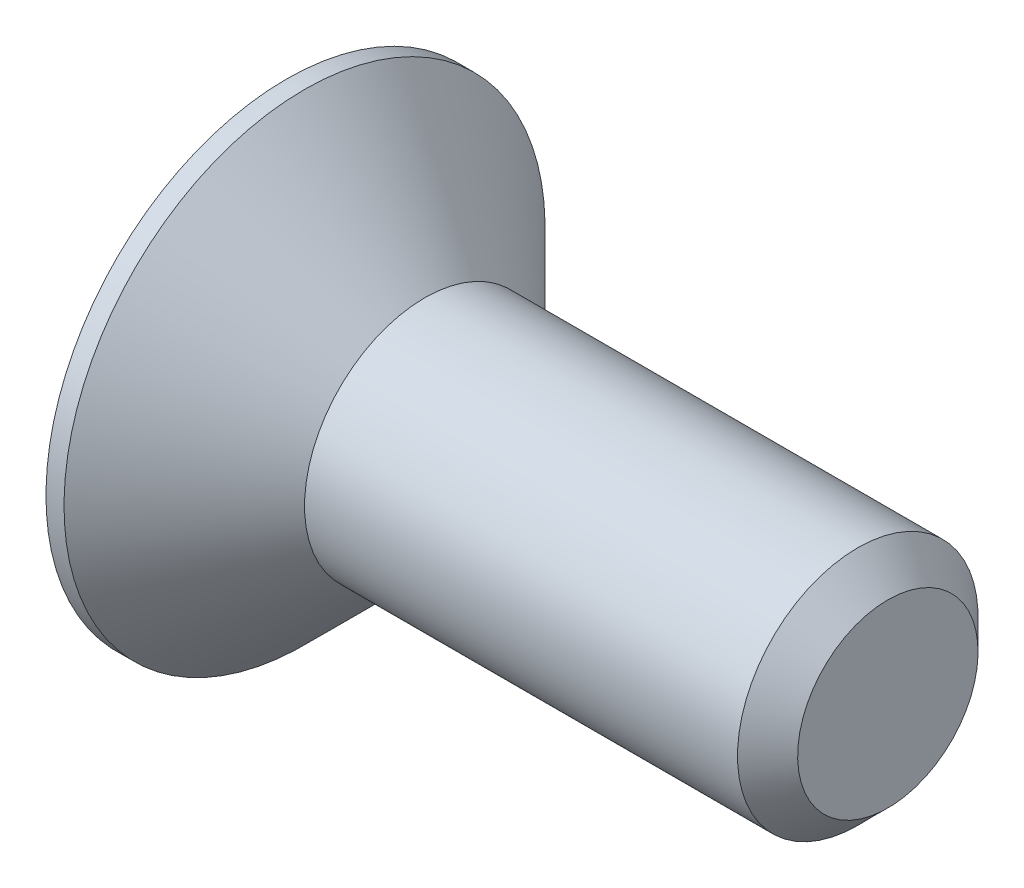
ISO-10303-21;
HEADER;
FILE_DESCRIPTION(('STEP AP214'),'2;1');
FILE_NAME('part.step','',(''),(''),'','','');
FILE_SCHEMA(('AUTOMOTIVE_DESIGN { 1 0 10303 214 1 1 1 1 }'));
ENDSEC;
DATA;
#1=APPLICATION_CONTEXT('core data for automotive mechanical design processes');
#2=APPLICATION_PROTOCOL_DEFINITION('international standard','automotive_design',2000,#1);
#3=PRODUCT_CONTEXT('',#1,'mechanical');
#4=PRODUCT('Part','Part','',(#3));
#5=PRODUCT_RELATED_PRODUCT_CATEGORY('part','',(#4));
#6=PRODUCT_DEFINITION_FORMATION('','',#4);
#7=PRODUCT_DEFINITION_CONTEXT('part definition',#1,'design');
#8=PRODUCT_DEFINITION('design','',#6,#7);
#9=PRODUCT_DEFINITION_SHAPE('','',#8);
#10=(LENGTH_UNIT() NAMED_UNIT(*) SI_UNIT(.MILLI.,.METRE.));
#11=(NAMED_UNIT(*) PLANE_ANGLE_UNIT() SI_UNIT($,.RADIAN.));
#12=(NAMED_UNIT(*) SI_UNIT($,.STERADIAN.) SOLID_ANGLE_UNIT());
#13=UNCERTAINTY_MEASURE_WITH_UNIT(LENGTH_MEASURE(1.E-05),#10,'distance_accuracy_value','');
#14=(GEOMETRIC_REPRESENTATION_CONTEXT(3) GLOBAL_UNCERTAINTY_ASSIGNED_CONTEXT((#13)) GLOBAL_UNIT_ASSIGNED_CONTEXT((#10,
#11,#12)) REPRESENTATION_CONTEXT('',''));
#15=CARTESIAN_POINT('',(0.,0.,0.));
#16=DIRECTION('',(0.,0.,1.));
#17=DIRECTION('',(1.,0.,0.));
#18=AXIS2_PLACEMENT_3D('',#15,#16,#17);
#19=CARTESIAN_POINT('',(0.,0.,0.));
#20=DIRECTION('',(-1.,0.,0.));
#21=DIRECTION('',(0.,-1.,0.));
#22=AXIS2_PLACEMENT_3D('',#19,#20,#21);
#23=PLANE('',#22);
#24=DIRECTION('',(0.,0.5,-0.866025403784439));
#25=VECTOR('',#24,1.);
#26=CARTESIAN_POINT('',(0.,0.721687836487033,1.25));
#27=LINE('',#26,#25);
#28=CARTESIAN_POINT('',(0.,0.721687836487033,1.25));
#29=VERTEX_POINT('',#28);
#30=CARTESIAN_POINT('',(0.,1.44337567297406,0.));
#31=VERTEX_POINT('',#30);
#32=EDGE_CURVE('E48',#29,#31,#27,.T.);
#33=ORIENTED_EDGE('',*,*,#32,.F.);
#34=DIRECTION('',(0.,1.,0.));
#35=VECTOR('',#34,1.);
#36=CARTESIAN_POINT('',(0.,-0.721687836487033,1.25));
#37=LINE('',#36,#35);
#38=CARTESIAN_POINT('',(0.,-0.721687836487033,1.25));
#39=VERTEX_POINT('',#38);
#40=EDGE_CURVE('E131',#39,#29,#37,.T.);
#41=ORIENTED_EDGE('',*,*,#40,.F.);
#42=DIRECTION('',(0.,0.5,0.866025403784439));
#43=VECTOR('',#42,1.);
#44=CARTESIAN_POINT('',(0.,-1.44337567297406,0.));
#45=LINE('',#44,#43);
#46=CARTESIAN_POINT('',(0.,-1.44337567297406,0.));
#47=VERTEX_POINT('',#46);
#48=EDGE_CURVE('E129',#47,#39,#45,.T.);
#49=ORIENTED_EDGE('',*,*,#48,.F.);
#50=DIRECTION('',(0.,-0.5,0.866025403784439));
#51=VECTOR('',#50,1.);
#52=CARTESIAN_POINT('',(0.,-0.721687836487032,-1.25));
#53=LINE('',#52,#51);
#54=CARTESIAN_POINT('',(0.,-0.721687836487032,-1.25));
#55=VERTEX_POINT('',#54);
#56=EDGE_CURVE('E96',#55,#47,#53,.T.);
#57=ORIENTED_EDGE('',*,*,#56,.F.);
#58=DIRECTION('',(0.,-1.,0.));
#59=VECTOR('',#58,1.);
#60=CARTESIAN_POINT('',(0.,0.721687836487033,-1.25));
#61=LINE('',#60,#59);
#62=CARTESIAN_POINT('',(0.,0.721687836487033,-1.25));
#63=VERTEX_POINT('',#62);
#64=EDGE_CURVE('E125',#63,#55,#61,.T.);
#65=ORIENTED_EDGE('',*,*,#64,.F.);
#66=DIRECTION('',(0.,-0.5,-0.866025403784439));
#67=VECTOR('',#66,1.);
#68=CARTESIAN_POINT('',(0.,1.44337567297406,0.));
#69=LINE('',#68,#67);
#70=EDGE_CURVE('E122',#31,#63,#69,.T.);
#71=ORIENTED_EDGE('',*,*,#70,.F.);
#72=EDGE_LOOP('',(#33,#41,#49,#57,#65,#71));
#73=FACE_BOUND('',#72,.T.);
#74=CARTESIAN_POINT('',(0.,0.,0.));
#75=DIRECTION('',(1.,0.,0.));
#76=DIRECTION('',(0.,1.,0.));
#77=AXIS2_PLACEMENT_3D('',#74,#75,#76);
#78=CIRCLE('',#77,4.);
#79=CARTESIAN_POINT('',(0.,4.,0.));
#80=VERTEX_POINT('',#79);
#81=EDGE_CURVE('E146',#80,#80,#78,.T.);
#82=ORIENTED_EDGE('',*,*,#81,.F.);
#83=EDGE_LOOP('',(#82));
#84=FACE_BOUND('',#83,.T.);
#85=ADVANCED_FACE('F33',(#73,#84),#23,.T.);
#86=CARTESIAN_POINT('',(10.,0.,0.));
#87=DIRECTION('',(1.,0.,0.));
#88=DIRECTION('',(0.,1.,0.));
#89=AXIS2_PLACEMENT_3D('',#86,#87,#88);
#90=CYLINDRICAL_SURFACE('',#89,4.);
#91=ORIENTED_EDGE('',*,*,#81,.T.);
#92=EDGE_LOOP('',(#91));
#93=FACE_BOUND('',#92,.T.);
#94=CARTESIAN_POINT('',(0.299999999999951,0.,0.));
#95=DIRECTION('',(1.,0.,0.));
#96=DIRECTION('',(0.,1.,0.));
#97=AXIS2_PLACEMENT_3D('',#94,#95,#96);
#98=CIRCLE('',#97,4.);
#99=CARTESIAN_POINT('',(0.299999999999951,4.,0.));
#100=VERTEX_POINT('',#99);
#101=EDGE_CURVE('E143',#100,#100,#98,.T.);
#102=ORIENTED_EDGE('',*,*,#101,.F.);
#103=EDGE_LOOP('',(#102));
#104=FACE_BOUND('',#103,.T.);
#105=ADVANCED_FACE('F166',(#93,#104),#90,.T.);
#106=CARTESIAN_POINT('',(2.3,0.,0.));
#107=DIRECTION('',(-1.,0.,0.));
#108=DIRECTION('',(0.,-1.,0.));
#109=AXIS2_PLACEMENT_3D('',#106,#107,#108);
#110=CONICAL_SURFACE('',#109,2.,0.785398163397436);
#111=ORIENTED_EDGE('',*,*,#101,.T.);
#112=EDGE_LOOP('',(#111));
#113=FACE_BOUND('',#112,.T.);
#114=CARTESIAN_POINT('',(2.3,0.,0.));
#115=DIRECTION('',(1.,0.,0.));
#116=DIRECTION('',(0.,1.,0.));
#117=AXIS2_PLACEMENT_3D('',#114,#115,#116);
#118=CIRCLE('',#117,2.);
#119=CARTESIAN_POINT('',(2.3,2.,0.));
#120=VERTEX_POINT('',#119);
#121=EDGE_CURVE('E135',#120,#120,#118,.T.);
#122=ORIENTED_EDGE('',*,*,#121,.F.);
#123=EDGE_LOOP('',(#122));
#124=FACE_BOUND('',#123,.T.);
#125=ADVANCED_FACE('F171',(#113,#124),#110,.T.);
#126=CARTESIAN_POINT('',(10.,0.,0.));
#127=DIRECTION('',(1.,0.,0.));
#128=DIRECTION('',(0.,1.,0.));
#129=AXIS2_PLACEMENT_3D('',#126,#127,#128);
#130=CYLINDRICAL_SURFACE('',#129,2.);
#131=CARTESIAN_POINT('',(9.5,0.,0.));
#132=DIRECTION('',(1.,0.,0.));
#133=DIRECTION('',(0.,1.,0.));
#134=AXIS2_PLACEMENT_3D('',#131,#132,#133);
#135=CIRCLE('',#134,2.);
#136=CARTESIAN_POINT('',(9.5,2.,0.));
#137=VERTEX_POINT('',#136);
#138=EDGE_CURVE('E11',#137,#137,#135,.F.);
#139=ORIENTED_EDGE('',*,*,#138,.T.);
#140=EDGE_LOOP('',(#139));
#141=FACE_BOUND('',#140,.T.);
#142=ORIENTED_EDGE('',*,*,#121,.T.);
#143=EDGE_LOOP('',(#142));
#144=FACE_BOUND('',#143,.T.);
#145=ADVANCED_FACE('F162',(#141,#144),#130,.T.);
#146=CARTESIAN_POINT('',(10.,2.,0.));
#147=DIRECTION('',(1.,0.,0.));
#148=DIRECTION('',(0.,1.,0.));
#149=AXIS2_PLACEMENT_3D('',#146,#147,#148);
#150=PLANE('',#149);
#151=CARTESIAN_POINT('',(10.,0.,0.));
#152=DIRECTION('',(1.,0.,0.));
#153=DIRECTION('',(0.,1.,0.));
#154=AXIS2_PLACEMENT_3D('',#151,#152,#153);
#155=CIRCLE('',#154,1.5);
#156=CARTESIAN_POINT('',(10.,1.5,0.));
#157=VERTEX_POINT('',#156);
#158=EDGE_CURVE('E41',#157,#157,#155,.T.);
#159=ORIENTED_EDGE('',*,*,#158,.T.);
#160=EDGE_LOOP('',(#159));
#161=FACE_BOUND('',#160,.T.);
#162=ADVANCED_FACE('F151',(#161),#150,.T.);
#163=CARTESIAN_POINT('',(10.,0.,0.));
#164=DIRECTION('',(-1.,0.,0.));
#165=DIRECTION('',(0.,-1.,0.));
#166=AXIS2_PLACEMENT_3D('',#163,#164,#165);
#167=CONICAL_SURFACE('',#166,1.5,0.785398163397447);
#168=ORIENTED_EDGE('',*,*,#138,.F.);
#169=EDGE_LOOP('',(#168));
#170=FACE_BOUND('',#169,.T.);
#171=ORIENTED_EDGE('',*,*,#158,.F.);
#172=EDGE_LOOP('',(#171));
#173=FACE_BOUND('',#172,.T.);
#174=ADVANCED_FACE('F35',(#170,#173),#167,.T.);
#175=CARTESIAN_POINT('',(1.8,0.721687836487032,1.25));
#176=DIRECTION('',(0.,0.866025403784438,0.5));
#177=DIRECTION('',(0.,-0.5,0.866025403784439));
#178=AXIS2_PLACEMENT_3D('',#175,#176,#177);
#179=PLANE('',#178);
#180=ORIENTED_EDGE('',*,*,#32,.T.);
#181=DIRECTION('',(-1.,0.,0.));
#182=VECTOR('',#181,1.);
#183=CARTESIAN_POINT('',(1.8,1.44337567297406,0.));
#184=LINE('',#183,#182);
#185=CARTESIAN_POINT('',(1.8,1.44337567297406,0.));
#186=VERTEX_POINT('',#185);
#187=EDGE_CURVE('E78',#186,#31,#184,.T.);
#188=ORIENTED_EDGE('',*,*,#187,.F.);
#189=DIRECTION('',(0.,0.5,-0.866025403784439));
#190=VECTOR('',#189,1.);
#191=CARTESIAN_POINT('',(1.8,0.721687836487032,1.25));
#192=LINE('',#191,#190);
#193=CARTESIAN_POINT('',(1.8,0.721687836487032,1.25));
#194=VERTEX_POINT('',#193);
#195=EDGE_CURVE('E133',#194,#186,#192,.T.);
#196=ORIENTED_EDGE('',*,*,#195,.F.);
#197=DIRECTION('',(-1.,0.,0.));
#198=VECTOR('',#197,1.);
#199=CARTESIAN_POINT('',(1.8,0.721687836487032,1.25));
#200=LINE('',#199,#198);
#201=EDGE_CURVE('E56',#194,#29,#200,.T.);
#202=ORIENTED_EDGE('',*,*,#201,.T.);
#203=EDGE_LOOP('',(#180,#188,#196,#202));
#204=FACE_BOUND('',#203,.T.);
#205=ADVANCED_FACE('F154',(#204),#179,.F.);
#206=CARTESIAN_POINT('',(1.8,-0.721687836487033,1.25));
#207=DIRECTION('',(0.,0.,1.));
#208=DIRECTION('',(0.,-1.,0.));
#209=AXIS2_PLACEMENT_3D('',#206,#207,#208);
#210=PLANE('',#209);
#211=ORIENTED_EDGE('',*,*,#40,.T.);
#212=ORIENTED_EDGE('',*,*,#201,.F.);
#213=DIRECTION('',(0.,1.,0.));
#214=VECTOR('',#213,1.);
#215=CARTESIAN_POINT('',(1.8,-0.721687836487033,1.25));
#216=LINE('',#215,#214);
#217=CARTESIAN_POINT('',(1.8,-0.721687836487033,1.25));
#218=VERTEX_POINT('',#217);
#219=EDGE_CURVE('E108',#218,#194,#216,.T.);
#220=ORIENTED_EDGE('',*,*,#219,.F.);
#221=DIRECTION('',(-1.,0.,0.));
#222=VECTOR('',#221,1.);
#223=CARTESIAN_POINT('',(1.8,-0.721687836487033,1.25));
#224=LINE('',#223,#222);
#225=EDGE_CURVE('E100',#218,#39,#224,.T.);
#226=ORIENTED_EDGE('',*,*,#225,.T.);
#227=EDGE_LOOP('',(#211,#212,#220,#226));
#228=FACE_BOUND('',#227,.T.);
#229=ADVANCED_FACE('F160',(#228),#210,.F.);
#230=CARTESIAN_POINT('',(1.8,-1.44337567297407,0.));
#231=DIRECTION('',(0.,-0.866025403784439,0.5));
#232=DIRECTION('',(0.,-0.5,-0.866025403784439));
#233=AXIS2_PLACEMENT_3D('',#230,#231,#232);
#234=PLANE('',#233);
#235=ORIENTED_EDGE('',*,*,#48,.T.);
#236=ORIENTED_EDGE('',*,*,#225,.F.);
#237=DIRECTION('',(0.,0.5,0.866025403784439));
#238=VECTOR('',#237,1.);
#239=CARTESIAN_POINT('',(1.8,-1.44337567297407,0.));
#240=LINE('',#239,#238);
#241=CARTESIAN_POINT('',(1.8,-1.44337567297407,0.));
#242=VERTEX_POINT('',#241);
#243=EDGE_CURVE('E104',#242,#218,#240,.T.);
#244=ORIENTED_EDGE('',*,*,#243,.F.);
#245=DIRECTION('',(-1.,0.,0.));
#246=VECTOR('',#245,1.);
#247=CARTESIAN_POINT('',(1.8,-1.44337567297407,0.));
#248=LINE('',#247,#246);
#249=EDGE_CURVE('E89',#242,#47,#248,.T.);
#250=ORIENTED_EDGE('',*,*,#249,.T.);
#251=EDGE_LOOP('',(#235,#236,#244,#250));
#252=FACE_BOUND('',#251,.T.);
#253=ADVANCED_FACE('F105',(#252),#234,.F.);
#254=CARTESIAN_POINT('',(1.8,-0.721687836487033,-1.25));
#255=DIRECTION('',(0.,-0.866025403784438,-0.5));
#256=DIRECTION('',(0.,0.5,-0.866025403784439));
#257=AXIS2_PLACEMENT_3D('',#254,#255,#256);
#258=PLANE('',#257);
#259=ORIENTED_EDGE('',*,*,#56,.T.);
#260=ORIENTED_EDGE('',*,*,#249,.F.);
#261=DIRECTION('',(0.,-0.5,0.866025403784439));
#262=VECTOR('',#261,1.);
#263=CARTESIAN_POINT('',(1.8,-0.721687836487033,-1.25));
#264=LINE('',#263,#262);
#265=CARTESIAN_POINT('',(1.8,-0.721687836487033,-1.25));
#266=VERTEX_POINT('',#265);
#267=EDGE_CURVE('E93',#266,#242,#264,.T.);
#268=ORIENTED_EDGE('',*,*,#267,.F.);
#269=DIRECTION('',(-1.,0.,0.));
#270=VECTOR('',#269,1.);
#271=CARTESIAN_POINT('',(1.8,-0.721687836487033,-1.25));
#272=LINE('',#271,#270);
#273=EDGE_CURVE('E101',#266,#55,#272,.T.);
#274=ORIENTED_EDGE('',*,*,#273,.T.);
#275=EDGE_LOOP('',(#259,#260,#268,#274));
#276=FACE_BOUND('',#275,.T.);
#277=ADVANCED_FACE('F91',(#276),#258,.F.);
#278=CARTESIAN_POINT('',(1.8,0.721687836487032,-1.25));
#279=DIRECTION('',(0.,0.,-1.));
#280=DIRECTION('',(-1.,0.,0.));
#281=AXIS2_PLACEMENT_3D('',#278,#279,#280);
#282=PLANE('',#281);
#283=ORIENTED_EDGE('',*,*,#64,.T.);
#284=ORIENTED_EDGE('',*,*,#273,.F.);
#285=DIRECTION('',(0.,-1.,0.));
#286=VECTOR('',#285,1.);
#287=CARTESIAN_POINT('',(1.8,0.721687836487032,-1.25));
#288=LINE('',#287,#286);
#289=CARTESIAN_POINT('',(1.8,0.721687836487032,-1.25));
#290=VERTEX_POINT('',#289);
#291=EDGE_CURVE('E114',#290,#266,#288,.T.);
#292=ORIENTED_EDGE('',*,*,#291,.F.);
#293=DIRECTION('',(-1.,0.,0.));
#294=VECTOR('',#293,1.);
#295=CARTESIAN_POINT('',(1.8,0.721687836487032,-1.25));
#296=LINE('',#295,#294);
#297=EDGE_CURVE('E138',#290,#63,#296,.T.);
#298=ORIENTED_EDGE('',*,*,#297,.T.);
#299=EDGE_LOOP('',(#283,#284,#292,#298));
#300=FACE_BOUND('',#299,.T.);
#301=ADVANCED_FACE('F185',(#300),#282,.F.);
#302=CARTESIAN_POINT('',(1.8,1.44337567297406,0.));
#303=DIRECTION('',(0.,0.866025403784439,-0.5));
#304=DIRECTION('',(0.,0.5,0.866025403784439));
#305=AXIS2_PLACEMENT_3D('',#302,#303,#304);
#306=PLANE('',#305);
#307=ORIENTED_EDGE('',*,*,#70,.T.);
#308=ORIENTED_EDGE('',*,*,#297,.F.);
#309=DIRECTION('',(0.,-0.5,-0.866025403784439));
#310=VECTOR('',#309,1.);
#311=CARTESIAN_POINT('',(1.8,1.44337567297406,0.));
#312=LINE('',#311,#310);
#313=EDGE_CURVE('E116',#186,#290,#312,.T.);
#314=ORIENTED_EDGE('',*,*,#313,.F.);
#315=ORIENTED_EDGE('',*,*,#187,.T.);
#316=EDGE_LOOP('',(#307,#308,#314,#315));
#317=FACE_BOUND('',#316,.T.);
#318=ADVANCED_FACE('F182',(#317),#306,.F.);
#319=CARTESIAN_POINT('',(1.8,0.,0.));
#320=DIRECTION('',(-1.,0.,0.));
#321=DIRECTION('',(0.,-1.,0.));
#322=AXIS2_PLACEMENT_3D('',#319,#320,#321);
#323=PLANE('',#322);
#324=ORIENTED_EDGE('',*,*,#195,.T.);
#325=ORIENTED_EDGE('',*,*,#313,.T.);
#326=ORIENTED_EDGE('',*,*,#291,.T.);
#327=ORIENTED_EDGE('',*,*,#267,.T.);
#328=ORIENTED_EDGE('',*,*,#243,.T.);
#329=ORIENTED_EDGE('',*,*,#219,.T.);
#330=EDGE_LOOP('',(#324,#325,#326,#327,#328,#329));
#331=FACE_BOUND('',#330,.T.);
#332=ADVANCED_FACE('F111',(#331),#323,.T.);
#333=CLOSED_SHELL('',(#85,#105,#125,#145,#162,#174,#205,#229,#253,#277,#301,#318,#332));
#334=MANIFOLD_SOLID_BREP('B2',#333);
#335=ADVANCED_BREP_SHAPE_REPRESENTATION('',(#18,#334),#14);
#336=SHAPE_DEFINITION_REPRESENTATION(#9,#335);
ENDSEC;
END-ISO-10303-21;
